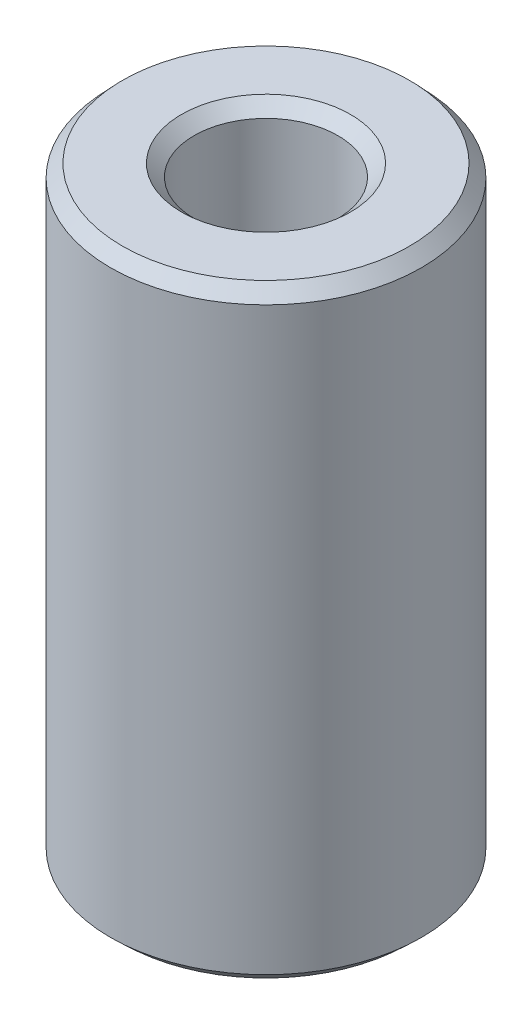
ISO-10303-21;
HEADER;
FILE_DESCRIPTION(('STEP AP214'),'2;1');
FILE_NAME('part.step','',(''),(''),'','','');
FILE_SCHEMA(('AUTOMOTIVE_DESIGN { 1 0 10303 214 1 1 1 1 }'));
ENDSEC;
DATA;
#1=APPLICATION_CONTEXT('core data for automotive mechanical design processes');
#2=APPLICATION_PROTOCOL_DEFINITION('international standard','automotive_design',2000,#1);
#3=PRODUCT_CONTEXT('',#1,'mechanical');
#4=PRODUCT('Part','Part','',(#3));
#5=PRODUCT_RELATED_PRODUCT_CATEGORY('part','',(#4));
#6=PRODUCT_DEFINITION_FORMATION('','',#4);
#7=PRODUCT_DEFINITION_CONTEXT('part definition',#1,'design');
#8=PRODUCT_DEFINITION('design','',#6,#7);
#9=PRODUCT_DEFINITION_SHAPE('','',#8);
#10=(LENGTH_UNIT() NAMED_UNIT(*) SI_UNIT(.MILLI.,.METRE.));
#11=(NAMED_UNIT(*) PLANE_ANGLE_UNIT() SI_UNIT($,.RADIAN.));
#12=(NAMED_UNIT(*) SI_UNIT($,.STERADIAN.) SOLID_ANGLE_UNIT());
#13=UNCERTAINTY_MEASURE_WITH_UNIT(LENGTH_MEASURE(1.E-05),#10,'distance_accuracy_value','');
#14=(GEOMETRIC_REPRESENTATION_CONTEXT(3) GLOBAL_UNCERTAINTY_ASSIGNED_CONTEXT((#13)) GLOBAL_UNIT_ASSIGNED_CONTEXT((#10,
#11,#12)) REPRESENTATION_CONTEXT('',''));
#15=CARTESIAN_POINT('',(0.,0.,0.));
#16=DIRECTION('',(0.,0.,1.));
#17=DIRECTION('',(1.,0.,0.));
#18=AXIS2_PLACEMENT_3D('',#15,#16,#17);
#19=CARTESIAN_POINT('',(0.,58.3264975888779,0.));
#20=DIRECTION('',(0.,-1.,0.));
#21=DIRECTION('',(0.,0.,-1.));
#22=AXIS2_PLACEMENT_3D('',#19,#20,#21);
#23=CYLINDRICAL_SURFACE('',#22,15.);
#24=CARTESIAN_POINT('',(0.,1.15008268459107,0.));
#25=DIRECTION('',(0.,1.,0.));
#26=DIRECTION('',(0.,0.,1.));
#27=AXIS2_PLACEMENT_3D('',#24,#25,#26);
#28=CIRCLE('',#27,15.);
#29=CARTESIAN_POINT('',(0.,1.15008268459107,15.));
#30=VERTEX_POINT('',#29);
#31=EDGE_CURVE('E10',#30,#30,#28,.T.);
#32=ORIENTED_EDGE('',*,*,#31,.T.);
#33=EDGE_LOOP('',(#32));
#34=FACE_BOUND('',#33,.T.);
#35=CARTESIAN_POINT('',(0.,57.0983632100363,0.));
#36=DIRECTION('',(0.,1.,0.));
#37=DIRECTION('',(0.,0.,1.));
#38=AXIS2_PLACEMENT_3D('',#35,#36,#37);
#39=CIRCLE('',#38,15.);
#40=CARTESIAN_POINT('',(0.,57.0983632100363,15.));
#41=VERTEX_POINT('',#40);
#42=EDGE_CURVE('E50',#41,#41,#39,.F.);
#43=ORIENTED_EDGE('',*,*,#42,.T.);
#44=EDGE_LOOP('',(#43));
#45=FACE_BOUND('',#44,.T.);
#46=ADVANCED_FACE('F39',(#34,#45),#23,.T.);
#47=CARTESIAN_POINT('',(0.,58.3264975888779,0.));
#48=DIRECTION('',(0.,1.,0.));
#49=DIRECTION('',(0.,0.,1.));
#50=AXIS2_PLACEMENT_3D('',#47,#48,#49);
#51=PLANE('',#50);
#52=CARTESIAN_POINT('',(0.,58.3264975888779,0.));
#53=DIRECTION('',(0.,1.,0.));
#54=DIRECTION('',(0.,0.,1.));
#55=AXIS2_PLACEMENT_3D('',#52,#53,#54);
#56=CIRCLE('',#55,8.1579021783016);
#57=CARTESIAN_POINT('',(0.,58.3264975888779,8.1579021783016));
#58=VERTEX_POINT('',#57);
#59=EDGE_CURVE('E58',#58,#58,#56,.F.);
#60=ORIENTED_EDGE('',*,*,#59,.T.);
#61=EDGE_LOOP('',(#60));
#62=FACE_BOUND('',#61,.T.);
#63=CARTESIAN_POINT('',(0.,58.3264975888779,0.));
#64=DIRECTION('',(0.,1.,0.));
#65=DIRECTION('',(0.,0.,1.));
#66=AXIS2_PLACEMENT_3D('',#63,#64,#65);
#67=CIRCLE('',#66,13.8499173154089);
#68=CARTESIAN_POINT('',(0.,58.3264975888779,13.8499173154089));
#69=VERTEX_POINT('',#68);
#70=EDGE_CURVE('E61',#69,#69,#67,.T.);
#71=ORIENTED_EDGE('',*,*,#70,.T.);
#72=EDGE_LOOP('',(#71));
#73=FACE_BOUND('',#72,.T.);
#74=ADVANCED_FACE('F88',(#62,#73),#51,.T.);
#75=CARTESIAN_POINT('',(0.,0.,0.));
#76=DIRECTION('',(0.,1.,0.));
#77=DIRECTION('',(0.,0.,1.));
#78=AXIS2_PLACEMENT_3D('',#75,#76,#77);
#79=PLANE('',#78);
#80=CARTESIAN_POINT('',(0.,0.,0.));
#81=DIRECTION('',(0.,1.,0.));
#82=DIRECTION('',(0.,0.,1.));
#83=AXIS2_PLACEMENT_3D('',#80,#81,#82);
#84=CIRCLE('',#83,8.079850484051);
#85=CARTESIAN_POINT('',(0.,0.,8.079850484051));
#86=VERTEX_POINT('',#85);
#87=EDGE_CURVE('E51',#86,#86,#84,.T.);
#88=ORIENTED_EDGE('',*,*,#87,.T.);
#89=EDGE_LOOP('',(#88));
#90=FACE_BOUND('',#89,.T.);
#91=CARTESIAN_POINT('',(0.,0.,0.));
#92=DIRECTION('',(0.,1.,0.));
#93=DIRECTION('',(0.,0.,1.));
#94=AXIS2_PLACEMENT_3D('',#91,#92,#93);
#95=CIRCLE('',#94,13.7718656211583);
#96=CARTESIAN_POINT('',(0.,0.,13.7718656211583));
#97=VERTEX_POINT('',#96);
#98=EDGE_CURVE('E54',#97,#97,#95,.F.);
#99=ORIENTED_EDGE('',*,*,#98,.T.);
#100=EDGE_LOOP('',(#99));
#101=FACE_BOUND('',#100,.T.);
#102=ADVANCED_FACE('F83',(#90,#101),#79,.F.);
#103=CARTESIAN_POINT('',(0.,58.3264975888779,0.));
#104=DIRECTION('',(0.,-1.,0.));
#105=DIRECTION('',(0.,0.,-1.));
#106=AXIS2_PLACEMENT_3D('',#103,#104,#105);
#107=CYLINDRICAL_SURFACE('',#106,6.92976779945993);
#108=CARTESIAN_POINT('',(0.,57.1764149042869,0.));
#109=DIRECTION('',(0.,1.,0.));
#110=DIRECTION('',(0.,0.,1.));
#111=AXIS2_PLACEMENT_3D('',#108,#109,#110);
#112=CIRCLE('',#111,6.92976779945993);
#113=CARTESIAN_POINT('',(0.,57.1764149042869,6.92976779945993));
#114=VERTEX_POINT('',#113);
#115=EDGE_CURVE('E67',#114,#114,#112,.T.);
#116=ORIENTED_EDGE('',*,*,#115,.T.);
#117=EDGE_LOOP('',(#116));
#118=FACE_BOUND('',#117,.T.);
#119=CARTESIAN_POINT('',(0.,1.22813437884168,0.));
#120=DIRECTION('',(0.,1.,0.));
#121=DIRECTION('',(0.,0.,1.));
#122=AXIS2_PLACEMENT_3D('',#119,#120,#121);
#123=CIRCLE('',#122,6.92976779945993);
#124=CARTESIAN_POINT('',(0.,1.22813437884168,6.92976779945993));
#125=VERTEX_POINT('',#124);
#126=EDGE_CURVE('E69',#125,#125,#123,.F.);
#127=ORIENTED_EDGE('',*,*,#126,.T.);
#128=EDGE_LOOP('',(#127));
#129=FACE_BOUND('',#128,.T.);
#130=ADVANCED_FACE('F71',(#118,#129),#107,.F.);
#131=CARTESIAN_POINT('',(0.,57.1764149042869,0.));
#132=DIRECTION('',(0.,1.,0.));
#133=DIRECTION('',(0.,0.,1.));
#134=AXIS2_PLACEMENT_3D('',#131,#132,#133);
#135=CONICAL_SURFACE('',#134,6.92976779945993,0.818205803213765);
#136=ORIENTED_EDGE('',*,*,#59,.F.);
#137=EDGE_LOOP('',(#136));
#138=FACE_BOUND('',#137,.T.);
#139=ORIENTED_EDGE('',*,*,#115,.F.);
#140=EDGE_LOOP('',(#139));
#141=FACE_BOUND('',#140,.T.);
#142=ADVANCED_FACE('F77',(#138,#141),#135,.F.);
#143=CARTESIAN_POINT('',(0.,0.,0.));
#144=DIRECTION('',(0.,-1.,0.));
#145=DIRECTION('',(0.,0.,-1.));
#146=AXIS2_PLACEMENT_3D('',#143,#144,#145);
#147=CONICAL_SURFACE('',#146,8.079850484051,0.752590523581134);
#148=ORIENTED_EDGE('',*,*,#126,.F.);
#149=EDGE_LOOP('',(#148));
#150=FACE_BOUND('',#149,.T.);
#151=ORIENTED_EDGE('',*,*,#87,.F.);
#152=EDGE_LOOP('',(#151));
#153=FACE_BOUND('',#152,.T.);
#154=ADVANCED_FACE('F73',(#150,#153),#147,.F.);
#155=CARTESIAN_POINT('',(0.,1.15008268459107,0.));
#156=DIRECTION('',(0.,1.,0.));
#157=DIRECTION('',(0.,0.,1.));
#158=AXIS2_PLACEMENT_3D('',#155,#156,#157);
#159=CONICAL_SURFACE('',#158,15.,0.818205803213763);
#160=ORIENTED_EDGE('',*,*,#98,.F.);
#161=EDGE_LOOP('',(#160));
#162=FACE_BOUND('',#161,.T.);
#163=ORIENTED_EDGE('',*,*,#31,.F.);
#164=EDGE_LOOP('',(#163));
#165=FACE_BOUND('',#164,.T.);
#166=ADVANCED_FACE('F76',(#162,#165),#159,.T.);
#167=CARTESIAN_POINT('',(0.,58.3264975888779,0.));
#168=DIRECTION('',(0.,-1.,0.));
#169=DIRECTION('',(0.,0.,-1.));
#170=AXIS2_PLACEMENT_3D('',#167,#168,#169);
#171=CONICAL_SURFACE('',#170,13.8499173154089,0.752590523581138);
#172=ORIENTED_EDGE('',*,*,#42,.F.);
#173=EDGE_LOOP('',(#172));
#174=FACE_BOUND('',#173,.T.);
#175=ORIENTED_EDGE('',*,*,#70,.F.);
#176=EDGE_LOOP('',(#175));
#177=FACE_BOUND('',#176,.T.);
#178=ADVANCED_FACE('F45',(#174,#177),#171,.T.);
#179=CLOSED_SHELL('',(#46,#74,#102,#130,#142,#154,#166,#178));
#180=MANIFOLD_SOLID_BREP('B2',#179);
#181=ADVANCED_BREP_SHAPE_REPRESENTATION('',(#18,#180),#14);
#182=SHAPE_DEFINITION_REPRESENTATION(#9,#181);
ENDSEC;
END-ISO-10303-21;
